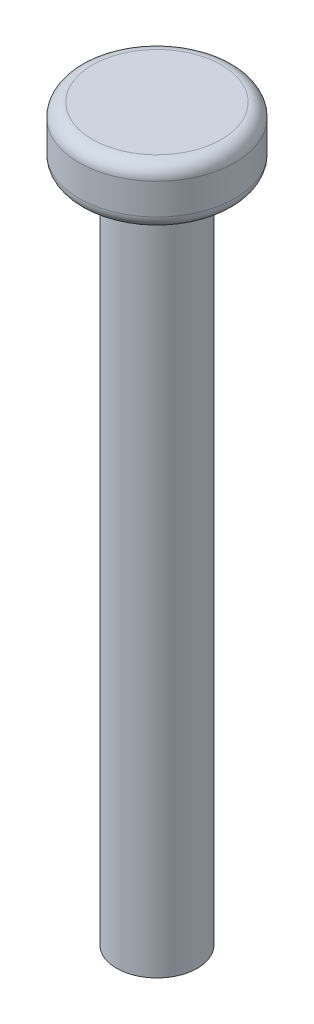
ISO-10303-21;
HEADER;
FILE_DESCRIPTION(('STEP AP214'),'2;1');
FILE_NAME('part.step','',(''),(''),'','','');
FILE_SCHEMA(('AUTOMOTIVE_DESIGN { 1 0 10303 214 1 1 1 1 }'));
ENDSEC;
DATA;
#1=APPLICATION_CONTEXT('core data for automotive mechanical design processes');
#2=APPLICATION_PROTOCOL_DEFINITION('international standard','automotive_design',2000,#1);
#3=PRODUCT_CONTEXT('',#1,'mechanical');
#4=PRODUCT('Part','Part','',(#3));
#5=PRODUCT_RELATED_PRODUCT_CATEGORY('part','',(#4));
#6=PRODUCT_DEFINITION_FORMATION('','',#4);
#7=PRODUCT_DEFINITION_CONTEXT('part definition',#1,'design');
#8=PRODUCT_DEFINITION('design','',#6,#7);
#9=PRODUCT_DEFINITION_SHAPE('','',#8);
#10=(LENGTH_UNIT() NAMED_UNIT(*) SI_UNIT(.MILLI.,.METRE.));
#11=(NAMED_UNIT(*) PLANE_ANGLE_UNIT() SI_UNIT($,.RADIAN.));
#12=(NAMED_UNIT(*) SI_UNIT($,.STERADIAN.) SOLID_ANGLE_UNIT());
#13=UNCERTAINTY_MEASURE_WITH_UNIT(LENGTH_MEASURE(1.E-05),#10,'distance_accuracy_value','');
#14=(GEOMETRIC_REPRESENTATION_CONTEXT(3) GLOBAL_UNCERTAINTY_ASSIGNED_CONTEXT((#13)) GLOBAL_UNIT_ASSIGNED_CONTEXT((#10,
#11,#12)) REPRESENTATION_CONTEXT('',''));
#15=CARTESIAN_POINT('',(0.,0.,0.));
#16=DIRECTION('',(0.,0.,1.));
#17=DIRECTION('',(1.,0.,0.));
#18=AXIS2_PLACEMENT_3D('',#15,#16,#17);
#19=CARTESIAN_POINT('',(0.,50.,0.));
#20=DIRECTION('',(0.,-1.,0.));
#21=DIRECTION('',(0.,0.,-1.));
#22=AXIS2_PLACEMENT_3D('',#19,#20,#21);
#23=CYLINDRICAL_SURFACE('',#22,3.);
#24=CARTESIAN_POINT('',(0.,50.,0.));
#25=DIRECTION('',(0.,1.,0.));
#26=DIRECTION('',(0.,0.,1.));
#27=AXIS2_PLACEMENT_3D('',#24,#25,#26);
#28=CIRCLE('',#27,3.);
#29=CARTESIAN_POINT('',(0.,50.,3.));
#30=VERTEX_POINT('',#29);
#31=EDGE_CURVE('E53',#30,#30,#28,.T.);
#32=ORIENTED_EDGE('',*,*,#31,.F.);
#33=EDGE_LOOP('',(#32));
#34=FACE_BOUND('',#33,.T.);
#35=CARTESIAN_POINT('',(0.,0.,0.));
#36=DIRECTION('',(0.,1.,0.));
#37=DIRECTION('',(0.,0.,1.));
#38=AXIS2_PLACEMENT_3D('',#35,#36,#37);
#39=CIRCLE('',#38,3.);
#40=CARTESIAN_POINT('',(0.,0.,3.));
#41=VERTEX_POINT('',#40);
#42=EDGE_CURVE('E54',#41,#41,#39,.T.);
#43=ORIENTED_EDGE('',*,*,#42,.T.);
#44=EDGE_LOOP('',(#43));
#45=FACE_BOUND('',#44,.T.);
#46=ADVANCED_FACE('F33',(#34,#45),#23,.T.);
#47=CARTESIAN_POINT('',(0.,0.,0.));
#48=DIRECTION('',(0.,1.,0.));
#49=DIRECTION('',(0.,0.,1.));
#50=AXIS2_PLACEMENT_3D('',#47,#48,#49);
#51=PLANE('',#50);
#52=ORIENTED_EDGE('',*,*,#42,.F.);
#53=EDGE_LOOP('',(#52));
#54=FACE_BOUND('',#53,.T.);
#55=ADVANCED_FACE('F64',(#54),#51,.F.);
#56=CARTESIAN_POINT('',(0.,54.3,0.));
#57=DIRECTION('',(0.,-1.,0.));
#58=DIRECTION('',(0.,0.,-1.));
#59=AXIS2_PLACEMENT_3D('',#56,#57,#58);
#60=CYLINDRICAL_SURFACE('',#59,5.8);
#61=CARTESIAN_POINT('',(0.,51.,0.));
#62=DIRECTION('',(0.,1.,0.));
#63=DIRECTION('',(0.,0.,1.));
#64=AXIS2_PLACEMENT_3D('',#61,#62,#63);
#65=CIRCLE('',#64,5.8);
#66=CARTESIAN_POINT('',(0.,51.,5.8));
#67=VERTEX_POINT('',#66);
#68=EDGE_CURVE('E44',#67,#67,#65,.T.);
#69=ORIENTED_EDGE('',*,*,#68,.T.);
#70=EDGE_LOOP('',(#69));
#71=FACE_BOUND('',#70,.T.);
#72=CARTESIAN_POINT('',(0.,53.3,0.));
#73=DIRECTION('',(0.,1.,0.));
#74=DIRECTION('',(0.,0.,1.));
#75=AXIS2_PLACEMENT_3D('',#72,#73,#74);
#76=CIRCLE('',#75,5.8);
#77=CARTESIAN_POINT('',(0.,53.3,5.8));
#78=VERTEX_POINT('',#77);
#79=EDGE_CURVE('E48',#78,#78,#76,.F.);
#80=ORIENTED_EDGE('',*,*,#79,.T.);
#81=EDGE_LOOP('',(#80));
#82=FACE_BOUND('',#81,.T.);
#83=ADVANCED_FACE('F69',(#71,#82),#60,.T.);
#84=CARTESIAN_POINT('',(0.,54.3,0.));
#85=DIRECTION('',(0.,1.,0.));
#86=DIRECTION('',(0.,0.,1.));
#87=AXIS2_PLACEMENT_3D('',#84,#85,#86);
#88=PLANE('',#87);
#89=CARTESIAN_POINT('',(0.,54.3,0.));
#90=DIRECTION('',(0.,1.,0.));
#91=DIRECTION('',(0.,0.,1.));
#92=AXIS2_PLACEMENT_3D('',#89,#90,#91);
#93=CIRCLE('',#92,4.8);
#94=CARTESIAN_POINT('',(0.,54.3,4.8));
#95=VERTEX_POINT('',#94);
#96=EDGE_CURVE('E10',#95,#95,#93,.T.);
#97=ORIENTED_EDGE('',*,*,#96,.T.);
#98=EDGE_LOOP('',(#97));
#99=FACE_BOUND('',#98,.T.);
#100=ADVANCED_FACE('F74',(#99),#88,.T.);
#101=CARTESIAN_POINT('',(0.,50.,0.));
#102=DIRECTION('',(0.,1.,0.));
#103=DIRECTION('',(0.,0.,1.));
#104=AXIS2_PLACEMENT_3D('',#101,#102,#103);
#105=PLANE('',#104);
#106=CARTESIAN_POINT('',(0.,50.,0.));
#107=DIRECTION('',(0.,1.,0.));
#108=DIRECTION('',(0.,0.,1.));
#109=AXIS2_PLACEMENT_3D('',#106,#107,#108);
#110=CIRCLE('',#109,4.8);
#111=CARTESIAN_POINT('',(0.,50.,4.8));
#112=VERTEX_POINT('',#111);
#113=EDGE_CURVE('E40',#112,#112,#110,.F.);
#114=ORIENTED_EDGE('',*,*,#113,.T.);
#115=EDGE_LOOP('',(#114));
#116=FACE_BOUND('',#115,.T.);
#117=ORIENTED_EDGE('',*,*,#31,.T.);
#118=EDGE_LOOP('',(#117));
#119=FACE_BOUND('',#118,.T.);
#120=ADVANCED_FACE('F60',(#116,#119),#105,.F.);
#121=CARTESIAN_POINT('',(0.,51.,0.));
#122=DIRECTION('',(0.,1.,0.));
#123=DIRECTION('',(0.,0.,1.));
#124=AXIS2_PLACEMENT_3D('',#121,#122,#123);
#125=TOROIDAL_SURFACE('',#124,4.8,1.);
#126=ORIENTED_EDGE('',*,*,#113,.F.);
#127=EDGE_LOOP('',(#126));
#128=FACE_BOUND('',#127,.T.);
#129=ORIENTED_EDGE('',*,*,#68,.F.);
#130=EDGE_LOOP('',(#129));
#131=FACE_BOUND('',#130,.T.);
#132=ADVANCED_FACE('F78',(#128,#131),#125,.T.);
#133=CARTESIAN_POINT('',(0.,53.3,0.));
#134=DIRECTION('',(0.,1.,0.));
#135=DIRECTION('',(0.,0.,1.));
#136=AXIS2_PLACEMENT_3D('',#133,#134,#135);
#137=TOROIDAL_SURFACE('',#136,4.8,1.);
#138=ORIENTED_EDGE('',*,*,#79,.F.);
#139=EDGE_LOOP('',(#138));
#140=FACE_BOUND('',#139,.T.);
#141=ORIENTED_EDGE('',*,*,#96,.F.);
#142=EDGE_LOOP('',(#141));
#143=FACE_BOUND('',#142,.T.);
#144=ADVANCED_FACE('F35',(#140,#143),#137,.T.);
#145=CLOSED_SHELL('',(#46,#55,#83,#100,#120,#132,#144));
#146=MANIFOLD_SOLID_BREP('B2',#145);
#147=ADVANCED_BREP_SHAPE_REPRESENTATION('',(#18,#146),#14);
#148=SHAPE_DEFINITION_REPRESENTATION(#9,#147);
ENDSEC;
END-ISO-10303-21;
